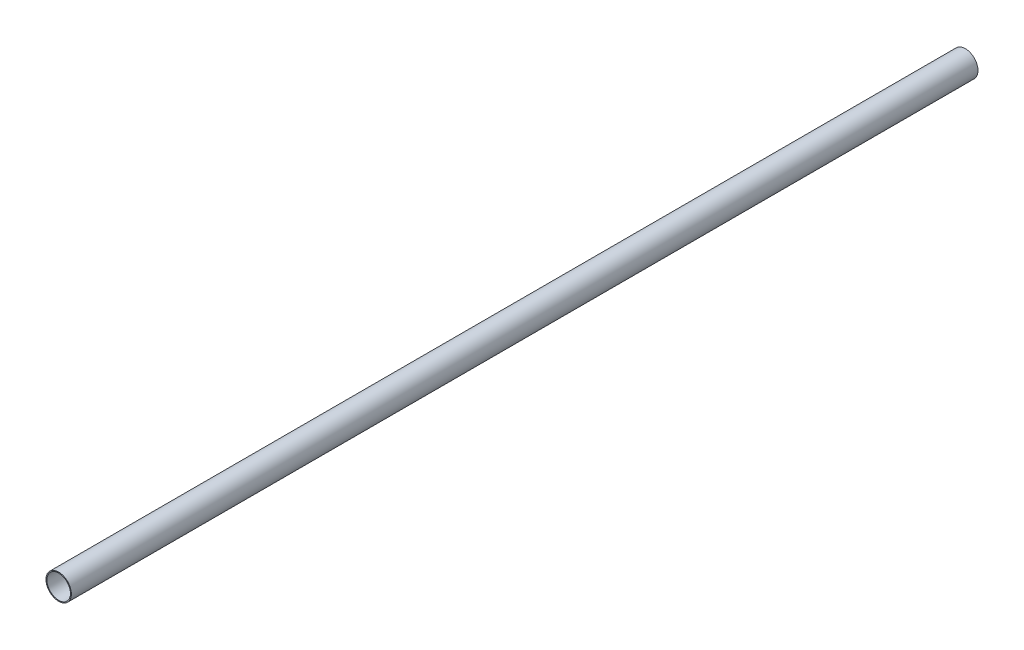
ISO-10303-21;
HEADER;
FILE_DESCRIPTION(('STEP AP214'),'2;1');
FILE_NAME('part.step','',(''),(''),'','','');
FILE_SCHEMA(('AUTOMOTIVE_DESIGN { 1 0 10303 214 1 1 1 1 }'));
ENDSEC;
DATA;
#1=APPLICATION_CONTEXT('core data for automotive mechanical design processes');
#2=APPLICATION_PROTOCOL_DEFINITION('international standard','automotive_design',2000,#1);
#3=PRODUCT_CONTEXT('',#1,'mechanical');
#4=PRODUCT('Part','Part','',(#3));
#5=PRODUCT_RELATED_PRODUCT_CATEGORY('part','',(#4));
#6=PRODUCT_DEFINITION_FORMATION('','',#4);
#7=PRODUCT_DEFINITION_CONTEXT('part definition',#1,'design');
#8=PRODUCT_DEFINITION('design','',#6,#7);
#9=PRODUCT_DEFINITION_SHAPE('','',#8);
#10=(LENGTH_UNIT() NAMED_UNIT(*) SI_UNIT(.MILLI.,.METRE.));
#11=(NAMED_UNIT(*) PLANE_ANGLE_UNIT() SI_UNIT($,.RADIAN.));
#12=(NAMED_UNIT(*) SI_UNIT($,.STERADIAN.) SOLID_ANGLE_UNIT());
#13=UNCERTAINTY_MEASURE_WITH_UNIT(LENGTH_MEASURE(1.E-05),#10,'distance_accuracy_value','');
#14=(GEOMETRIC_REPRESENTATION_CONTEXT(3) GLOBAL_UNCERTAINTY_ASSIGNED_CONTEXT((#13)) GLOBAL_UNIT_ASSIGNED_CONTEXT((#10,
#11,#12)) REPRESENTATION_CONTEXT('',''));
#15=CARTESIAN_POINT('',(0.,0.,0.));
#16=DIRECTION('',(0.,0.,1.));
#17=DIRECTION('',(1.,0.,0.));
#18=AXIS2_PLACEMENT_3D('',#15,#16,#17);
#19=CARTESIAN_POINT('',(0.,0.,-1000.));
#20=DIRECTION('',(0.,0.,1.));
#21=DIRECTION('',(1.,0.,0.));
#22=AXIS2_PLACEMENT_3D('',#19,#20,#21);
#23=CYLINDRICAL_SURFACE('',#22,14.);
#24=CARTESIAN_POINT('',(0.,0.,-1000.));
#25=DIRECTION('',(0.,0.,1.));
#26=DIRECTION('',(1.,0.,0.));
#27=AXIS2_PLACEMENT_3D('',#24,#25,#26);
#28=CIRCLE('',#27,14.);
#29=CARTESIAN_POINT('',(14.,0.,-1000.));
#30=VERTEX_POINT('',#29);
#31=EDGE_CURVE('E10',#30,#30,#28,.T.);
#32=ORIENTED_EDGE('',*,*,#31,.T.);
#33=EDGE_LOOP('',(#32));
#34=FACE_BOUND('',#33,.T.);
#35=CARTESIAN_POINT('',(0.,0.,0.));
#36=DIRECTION('',(0.,0.,1.));
#37=DIRECTION('',(1.,0.,0.));
#38=AXIS2_PLACEMENT_3D('',#35,#36,#37);
#39=CIRCLE('',#38,14.);
#40=CARTESIAN_POINT('',(14.,0.,0.));
#41=VERTEX_POINT('',#40);
#42=EDGE_CURVE('E34',#41,#41,#39,.T.);
#43=ORIENTED_EDGE('',*,*,#42,.F.);
#44=EDGE_LOOP('',(#43));
#45=FACE_BOUND('',#44,.T.);
#46=ADVANCED_FACE('F31',(#34,#45),#23,.T.);
#47=CARTESIAN_POINT('',(0.,0.,-1000.));
#48=DIRECTION('',(0.,0.,1.));
#49=DIRECTION('',(1.,0.,0.));
#50=AXIS2_PLACEMENT_3D('',#47,#48,#49);
#51=PLANE('',#50);
#52=CARTESIAN_POINT('',(0.,0.,-1000.));
#53=DIRECTION('',(0.,0.,1.));
#54=DIRECTION('',(1.,0.,0.));
#55=AXIS2_PLACEMENT_3D('',#52,#53,#54);
#56=CIRCLE('',#55,13.);
#57=CARTESIAN_POINT('',(13.,0.,-1000.));
#58=VERTEX_POINT('',#57);
#59=EDGE_CURVE('E41',#58,#58,#56,.T.);
#60=ORIENTED_EDGE('',*,*,#59,.T.);
#61=EDGE_LOOP('',(#60));
#62=FACE_BOUND('',#61,.T.);
#63=ORIENTED_EDGE('',*,*,#31,.F.);
#64=EDGE_LOOP('',(#63));
#65=FACE_BOUND('',#64,.T.);
#66=ADVANCED_FACE('F49',(#62,#65),#51,.F.);
#67=CARTESIAN_POINT('',(0.,0.,0.));
#68=DIRECTION('',(0.,0.,1.));
#69=DIRECTION('',(1.,0.,0.));
#70=AXIS2_PLACEMENT_3D('',#67,#68,#69);
#71=PLANE('',#70);
#72=CARTESIAN_POINT('',(0.,0.,0.));
#73=DIRECTION('',(0.,0.,1.));
#74=DIRECTION('',(1.,0.,0.));
#75=AXIS2_PLACEMENT_3D('',#72,#73,#74);
#76=CIRCLE('',#75,13.);
#77=CARTESIAN_POINT('',(13.,0.,0.));
#78=VERTEX_POINT('',#77);
#79=EDGE_CURVE('E43',#78,#78,#76,.T.);
#80=ORIENTED_EDGE('',*,*,#79,.F.);
#81=EDGE_LOOP('',(#80));
#82=FACE_BOUND('',#81,.T.);
#83=ORIENTED_EDGE('',*,*,#42,.T.);
#84=EDGE_LOOP('',(#83));
#85=FACE_BOUND('',#84,.T.);
#86=ADVANCED_FACE('F55',(#82,#85),#71,.T.);
#87=CARTESIAN_POINT('',(0.,0.,-1000.));
#88=DIRECTION('',(0.,0.,1.));
#89=DIRECTION('',(1.,0.,0.));
#90=AXIS2_PLACEMENT_3D('',#87,#88,#89);
#91=CYLINDRICAL_SURFACE('',#90,13.);
#92=ORIENTED_EDGE('',*,*,#59,.F.);
#93=EDGE_LOOP('',(#92));
#94=FACE_BOUND('',#93,.T.);
#95=ORIENTED_EDGE('',*,*,#79,.T.);
#96=EDGE_LOOP('',(#95));
#97=FACE_BOUND('',#96,.T.);
#98=ADVANCED_FACE('F52',(#94,#97),#91,.F.);
#99=CLOSED_SHELL('',(#46,#66,#86,#98));
#100=MANIFOLD_SOLID_BREP('B2',#99);
#101=ADVANCED_BREP_SHAPE_REPRESENTATION('',(#18,#100),#14);
#102=SHAPE_DEFINITION_REPRESENTATION(#9,#101);
ENDSEC;
END-ISO-10303-21;
